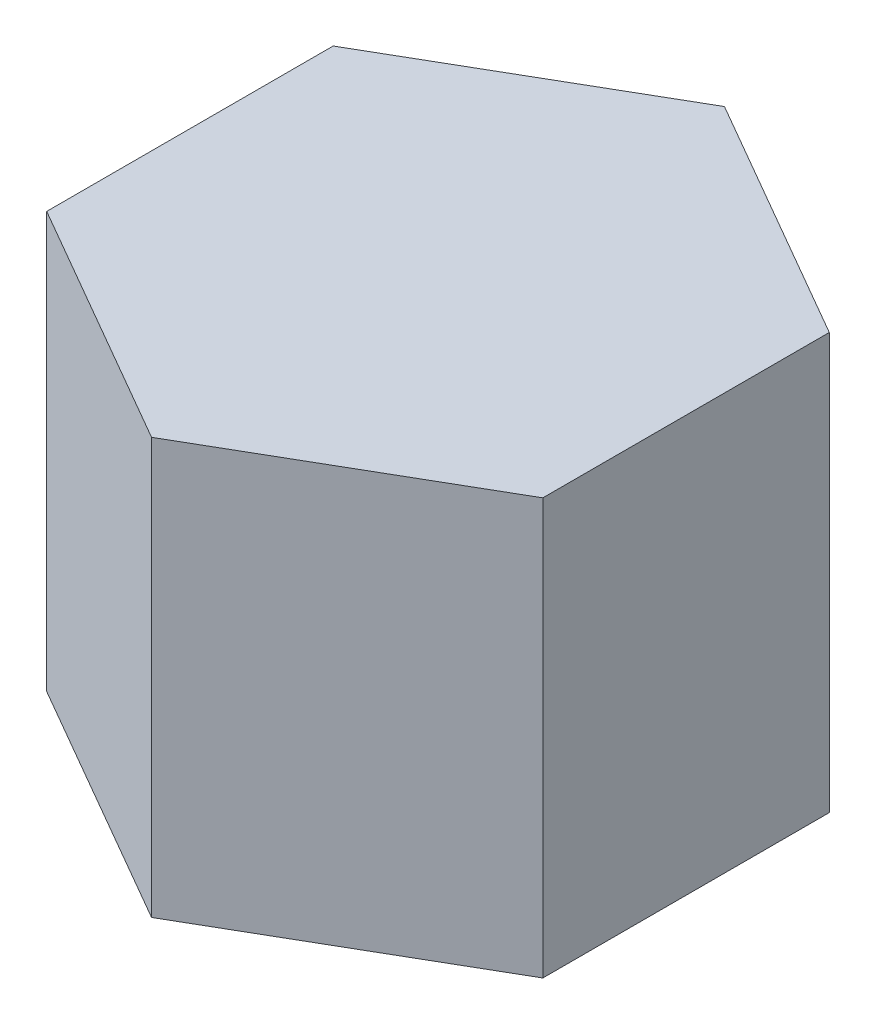
ISO-10303-21;
HEADER;
FILE_DESCRIPTION(('STEP AP214'),'2;1');
FILE_NAME('part.step','',(''),(''),'','','');
FILE_SCHEMA(('AUTOMOTIVE_DESIGN { 1 0 10303 214 1 1 1 1 }'));
ENDSEC;
DATA;
#1=APPLICATION_CONTEXT('core data for automotive mechanical design processes');
#2=APPLICATION_PROTOCOL_DEFINITION('international standard','automotive_design',2000,#1);
#3=PRODUCT_CONTEXT('',#1,'mechanical');
#4=PRODUCT('Part','Part','',(#3));
#5=PRODUCT_RELATED_PRODUCT_CATEGORY('part','',(#4));
#6=PRODUCT_DEFINITION_FORMATION('','',#4);
#7=PRODUCT_DEFINITION_CONTEXT('part definition',#1,'design');
#8=PRODUCT_DEFINITION('design','',#6,#7);
#9=PRODUCT_DEFINITION_SHAPE('','',#8);
#10=(LENGTH_UNIT() NAMED_UNIT(*) SI_UNIT(.MILLI.,.METRE.));
#11=(NAMED_UNIT(*) PLANE_ANGLE_UNIT() SI_UNIT($,.RADIAN.));
#12=(NAMED_UNIT(*) SI_UNIT($,.STERADIAN.) SOLID_ANGLE_UNIT());
#13=UNCERTAINTY_MEASURE_WITH_UNIT(LENGTH_MEASURE(1.E-05),#10,'distance_accuracy_value','');
#14=(GEOMETRIC_REPRESENTATION_CONTEXT(3) GLOBAL_UNCERTAINTY_ASSIGNED_CONTEXT((#13)) GLOBAL_UNIT_ASSIGNED_CONTEXT((#10,
#11,#12)) REPRESENTATION_CONTEXT('',''));
#15=CARTESIAN_POINT('',(0.,0.,0.));
#16=DIRECTION('',(0.,0.,1.));
#17=DIRECTION('',(1.,0.,0.));
#18=AXIS2_PLACEMENT_3D('',#15,#16,#17);
#19=CARTESIAN_POINT('',(205.642660308706,-148.537700895744,288.042869605357));
#20=DIRECTION('',(-0.499999999999943,0.,-0.866025403784472));
#21=DIRECTION('',(-0.866025403784472,0.,0.499999999999943));
#22=AXIS2_PLACEMENT_3D('',#19,#20,#21);
#23=PLANE('',#22);
#24=CARTESIAN_POINT('',(205.339551417382,-149.045793579175,288.217869605357));
#25=DIRECTION('',(0.866025403784471,0.,-0.499999999999943));
#26=VECTOR('',#25,1.);
#27=LINE('',#24,#26);
#28=CARTESIAN_POINT('',(205.339551417382,-149.045793579175,288.217869605357));
#29=VERTEX_POINT('',#28);
#30=CARTESIAN_POINT('',(205.642660308706,-149.045793579175,288.042869605357));
#31=VERTEX_POINT('',#30);
#32=EDGE_CURVE('E170',#29,#31,#27,.T.);
#33=ORIENTED_EDGE('',*,*,#32,.T.);
#34=CARTESIAN_POINT('',(205.642660308706,-148.537700895744,288.042869605357));
#35=DIRECTION('',(0.,-1.,0.));
#36=VECTOR('',#35,1.);
#37=LINE('',#34,#36);
#38=CARTESIAN_POINT('',(205.642660308706,-148.537700895744,288.042869605357));
#39=VERTEX_POINT('',#38);
#40=EDGE_CURVE('E35',#39,#31,#37,.T.);
#41=ORIENTED_EDGE('',*,*,#40,.F.);
#42=CARTESIAN_POINT('',(205.339551417382,-148.537700895744,288.217869605357));
#43=DIRECTION('',(0.866025403784471,0.,-0.499999999999943));
#44=VECTOR('',#43,1.);
#45=LINE('',#42,#44);
#46=CARTESIAN_POINT('',(205.339551417382,-148.537700895744,288.217869605357));
#47=VERTEX_POINT('',#46);
#48=EDGE_CURVE('E159',#47,#39,#45,.T.);
#49=ORIENTED_EDGE('',*,*,#48,.F.);
#50=CARTESIAN_POINT('',(205.339551417382,-148.537700895744,288.217869605357));
#51=DIRECTION('',(0.,-1.,0.));
#52=VECTOR('',#51,1.);
#53=LINE('',#50,#52);
#54=EDGE_CURVE('E10',#47,#29,#53,.T.);
#55=ORIENTED_EDGE('',*,*,#54,.T.);
#56=EDGE_LOOP('',(#33,#41,#49,#55));
#57=FACE_BOUND('',#56,.T.);
#58=ADVANCED_FACE('F16',(#57),#23,.F.);
#59=CARTESIAN_POINT('',(205.339551417382,-148.537700895744,288.217869605357));
#60=DIRECTION('',(0.500000000000062,0.,-0.866025403784403));
#61=DIRECTION('',(-0.866025403784403,0.,-0.500000000000062));
#62=AXIS2_PLACEMENT_3D('',#59,#60,#61);
#63=PLANE('',#62);
#64=CARTESIAN_POINT('',(205.036442526057,-149.045793579175,288.042869605357));
#65=DIRECTION('',(0.866025403784403,0.,0.500000000000062));
#66=VECTOR('',#65,1.);
#67=LINE('',#64,#66);
#68=CARTESIAN_POINT('',(205.036442526057,-149.045793579175,288.042869605357));
#69=VERTEX_POINT('',#68);
#70=EDGE_CURVE('E167',#69,#29,#67,.T.);
#71=ORIENTED_EDGE('',*,*,#70,.T.);
#72=ORIENTED_EDGE('',*,*,#54,.F.);
#73=CARTESIAN_POINT('',(205.036442526057,-148.537700895744,288.042869605357));
#74=DIRECTION('',(0.866025403784403,0.,0.500000000000062));
#75=VECTOR('',#74,1.);
#76=LINE('',#73,#75);
#77=CARTESIAN_POINT('',(205.036442526057,-148.537700895744,288.042869605357));
#78=VERTEX_POINT('',#77);
#79=EDGE_CURVE('E156',#78,#47,#76,.T.);
#80=ORIENTED_EDGE('',*,*,#79,.F.);
#81=CARTESIAN_POINT('',(205.036442526057,-148.537700895744,288.042869605357));
#82=DIRECTION('',(0.,-1.,0.));
#83=VECTOR('',#82,1.);
#84=LINE('',#81,#83);
#85=EDGE_CURVE('E27',#78,#69,#84,.T.);
#86=ORIENTED_EDGE('',*,*,#85,.T.);
#87=EDGE_LOOP('',(#71,#72,#80,#86));
#88=FACE_BOUND('',#87,.T.);
#89=ADVANCED_FACE('F189',(#88),#63,.F.);
#90=CARTESIAN_POINT('',(205.036442526057,-148.537700895744,290.831971220494));
#91=DIRECTION('',(1.,0.,0.));
#92=DIRECTION('',(0.,1.,0.));
#93=AXIS2_PLACEMENT_3D('',#90,#91,#92);
#94=PLANE('',#93);
#95=CARTESIAN_POINT('',(205.036442526057,-149.045793579175,287.692869605357));
#96=DIRECTION('',(0.,0.,1.));
#97=VECTOR('',#96,1.);
#98=LINE('',#95,#97);
#99=CARTESIAN_POINT('',(205.036442526057,-149.045793579175,287.692869605357));
#100=VERTEX_POINT('',#99);
#101=EDGE_CURVE('E163',#100,#69,#98,.T.);
#102=ORIENTED_EDGE('',*,*,#101,.T.);
#103=ORIENTED_EDGE('',*,*,#85,.F.);
#104=CARTESIAN_POINT('',(205.036442526057,-148.537700895744,287.692869605357));
#105=DIRECTION('',(0.,0.,1.));
#106=VECTOR('',#105,1.);
#107=LINE('',#104,#106);
#108=CARTESIAN_POINT('',(205.036442526057,-148.537700895744,287.692869605357));
#109=VERTEX_POINT('',#108);
#110=EDGE_CURVE('E106',#109,#78,#107,.T.);
#111=ORIENTED_EDGE('',*,*,#110,.F.);
#112=CARTESIAN_POINT('',(205.036442526057,-148.537700895744,287.692869605357));
#113=DIRECTION('',(0.,-1.,0.));
#114=VECTOR('',#113,1.);
#115=LINE('',#112,#114);
#116=EDGE_CURVE('E94',#109,#100,#115,.T.);
#117=ORIENTED_EDGE('',*,*,#116,.T.);
#118=EDGE_LOOP('',(#102,#103,#111,#117));
#119=FACE_BOUND('',#118,.T.);
#120=ADVANCED_FACE('F198',(#119),#94,.F.);
#121=CARTESIAN_POINT('',(205.036442526057,-148.537700895744,287.692869605357));
#122=DIRECTION('',(0.499999999999978,0.,0.866025403784452));
#123=DIRECTION('',(0.866025403784452,0.,-0.499999999999978));
#124=AXIS2_PLACEMENT_3D('',#121,#122,#123);
#125=PLANE('',#124);
#126=CARTESIAN_POINT('',(205.339551417382,-149.045793579175,287.517869605357));
#127=DIRECTION('',(-0.866025403784452,0.,0.499999999999978));
#128=VECTOR('',#127,1.);
#129=LINE('',#126,#128);
#130=CARTESIAN_POINT('',(205.339551417382,-149.045793579175,287.517869605357));
#131=VERTEX_POINT('',#130);
#132=EDGE_CURVE('E162',#131,#100,#129,.T.);
#133=ORIENTED_EDGE('',*,*,#132,.T.);
#134=ORIENTED_EDGE('',*,*,#116,.F.);
#135=CARTESIAN_POINT('',(205.339551417382,-148.537700895744,287.517869605357));
#136=DIRECTION('',(-0.866025403784452,0.,0.499999999999978));
#137=VECTOR('',#136,1.);
#138=LINE('',#135,#137);
#139=CARTESIAN_POINT('',(205.339551417382,-148.537700895744,287.517869605357));
#140=VERTEX_POINT('',#139);
#141=EDGE_CURVE('E98',#140,#109,#138,.T.);
#142=ORIENTED_EDGE('',*,*,#141,.F.);
#143=CARTESIAN_POINT('',(205.339551417382,-148.537700895744,287.517869605357));
#144=DIRECTION('',(0.,-1.,0.));
#145=VECTOR('',#144,1.);
#146=LINE('',#143,#145);
#147=EDGE_CURVE('E79',#140,#131,#146,.T.);
#148=ORIENTED_EDGE('',*,*,#147,.T.);
#149=EDGE_LOOP('',(#133,#134,#142,#148));
#150=FACE_BOUND('',#149,.T.);
#151=ADVANCED_FACE('F100',(#150),#125,.F.);
#152=CARTESIAN_POINT('',(205.339551417382,-148.537700895744,287.517869605357));
#153=DIRECTION('',(-0.499999999999943,0.,0.866025403784472));
#154=DIRECTION('',(0.866025403784472,0.,0.499999999999943));
#155=AXIS2_PLACEMENT_3D('',#152,#153,#154);
#156=PLANE('',#155);
#157=CARTESIAN_POINT('',(205.642660308706,-149.045793579175,287.692869605357));
#158=DIRECTION('',(-0.866025403784471,0.,-0.499999999999943));
#159=VECTOR('',#158,1.);
#160=LINE('',#157,#159);
#161=CARTESIAN_POINT('',(205.642660308706,-149.045793579175,287.692869605357));
#162=VERTEX_POINT('',#161);
#163=EDGE_CURVE('E88',#162,#131,#160,.T.);
#164=ORIENTED_EDGE('',*,*,#163,.T.);
#165=ORIENTED_EDGE('',*,*,#147,.F.);
#166=CARTESIAN_POINT('',(205.642660308706,-148.537700895744,287.692869605357));
#167=DIRECTION('',(-0.866025403784471,0.,-0.499999999999943));
#168=VECTOR('',#167,1.);
#169=LINE('',#166,#168);
#170=CARTESIAN_POINT('',(205.642660308706,-148.537700895744,287.692869605357));
#171=VERTEX_POINT('',#170);
#172=EDGE_CURVE('E84',#171,#140,#169,.T.);
#173=ORIENTED_EDGE('',*,*,#172,.F.);
#174=CARTESIAN_POINT('',(205.642660308706,-148.537700895744,287.692869605357));
#175=DIRECTION('',(0.,-1.,0.));
#176=VECTOR('',#175,1.);
#177=LINE('',#174,#176);
#178=EDGE_CURVE('E58',#171,#162,#177,.T.);
#179=ORIENTED_EDGE('',*,*,#178,.T.);
#180=EDGE_LOOP('',(#164,#165,#173,#179));
#181=FACE_BOUND('',#180,.T.);
#182=ADVANCED_FACE('F82',(#181),#156,.F.);
#183=CARTESIAN_POINT('',(205.642660308706,-148.537700895744,290.831971220494));
#184=DIRECTION('',(-1.,0.,0.));
#185=DIRECTION('',(0.,-1.,0.));
#186=AXIS2_PLACEMENT_3D('',#183,#184,#185);
#187=PLANE('',#186);
#188=CARTESIAN_POINT('',(205.642660308706,-149.045793579175,288.042869605357));
#189=DIRECTION('',(0.,0.,-1.));
#190=VECTOR('',#189,1.);
#191=LINE('',#188,#190);
#192=EDGE_CURVE('E160',#31,#162,#191,.T.);
#193=ORIENTED_EDGE('',*,*,#192,.T.);
#194=ORIENTED_EDGE('',*,*,#178,.F.);
#195=CARTESIAN_POINT('',(205.642660308706,-148.537700895744,288.042869605357));
#196=DIRECTION('',(0.,0.,-1.));
#197=VECTOR('',#196,1.);
#198=LINE('',#195,#197);
#199=EDGE_CURVE('E112',#39,#171,#198,.T.);
#200=ORIENTED_EDGE('',*,*,#199,.F.);
#201=ORIENTED_EDGE('',*,*,#40,.T.);
#202=EDGE_LOOP('',(#193,#194,#200,#201));
#203=FACE_BOUND('',#202,.T.);
#204=ADVANCED_FACE('F131',(#203),#187,.F.);
#205=CARTESIAN_POINT('',(206.339551417382,-148.537700895744,290.831971220494));
#206=DIRECTION('',(0.,-1.,0.));
#207=DIRECTION('',(1.,0.,0.));
#208=AXIS2_PLACEMENT_3D('',#205,#206,#207);
#209=PLANE('',#208);
#210=ORIENTED_EDGE('',*,*,#48,.T.);
#211=ORIENTED_EDGE('',*,*,#199,.T.);
#212=ORIENTED_EDGE('',*,*,#172,.T.);
#213=ORIENTED_EDGE('',*,*,#141,.T.);
#214=ORIENTED_EDGE('',*,*,#110,.T.);
#215=ORIENTED_EDGE('',*,*,#79,.T.);
#216=EDGE_LOOP('',(#210,#211,#212,#213,#214,#215));
#217=FACE_BOUND('',#216,.T.);
#218=ADVANCED_FACE('F111',(#217),#209,.F.);
#219=CARTESIAN_POINT('',(206.339551417382,-149.045793579175,290.831971220494));
#220=DIRECTION('',(0.,-1.,0.));
#221=DIRECTION('',(1.,0.,0.));
#222=AXIS2_PLACEMENT_3D('',#219,#220,#221);
#223=PLANE('',#222);
#224=ORIENTED_EDGE('',*,*,#32,.F.);
#225=ORIENTED_EDGE('',*,*,#70,.F.);
#226=ORIENTED_EDGE('',*,*,#101,.F.);
#227=ORIENTED_EDGE('',*,*,#132,.F.);
#228=ORIENTED_EDGE('',*,*,#163,.F.);
#229=ORIENTED_EDGE('',*,*,#192,.F.);
#230=EDGE_LOOP('',(#224,#225,#226,#227,#228,#229));
#231=FACE_BOUND('',#230,.T.);
#232=ADVANCED_FACE('F130',(#231),#223,.T.);
#233=CLOSED_SHELL('',(#58,#89,#120,#151,#182,#204,#218,#232));
#234=MANIFOLD_SOLID_BREP('B1',#233);
#235=ADVANCED_BREP_SHAPE_REPRESENTATION('',(#18,#234),#14);
#236=SHAPE_DEFINITION_REPRESENTATION(#9,#235);
ENDSEC;
END-ISO-10303-21;
